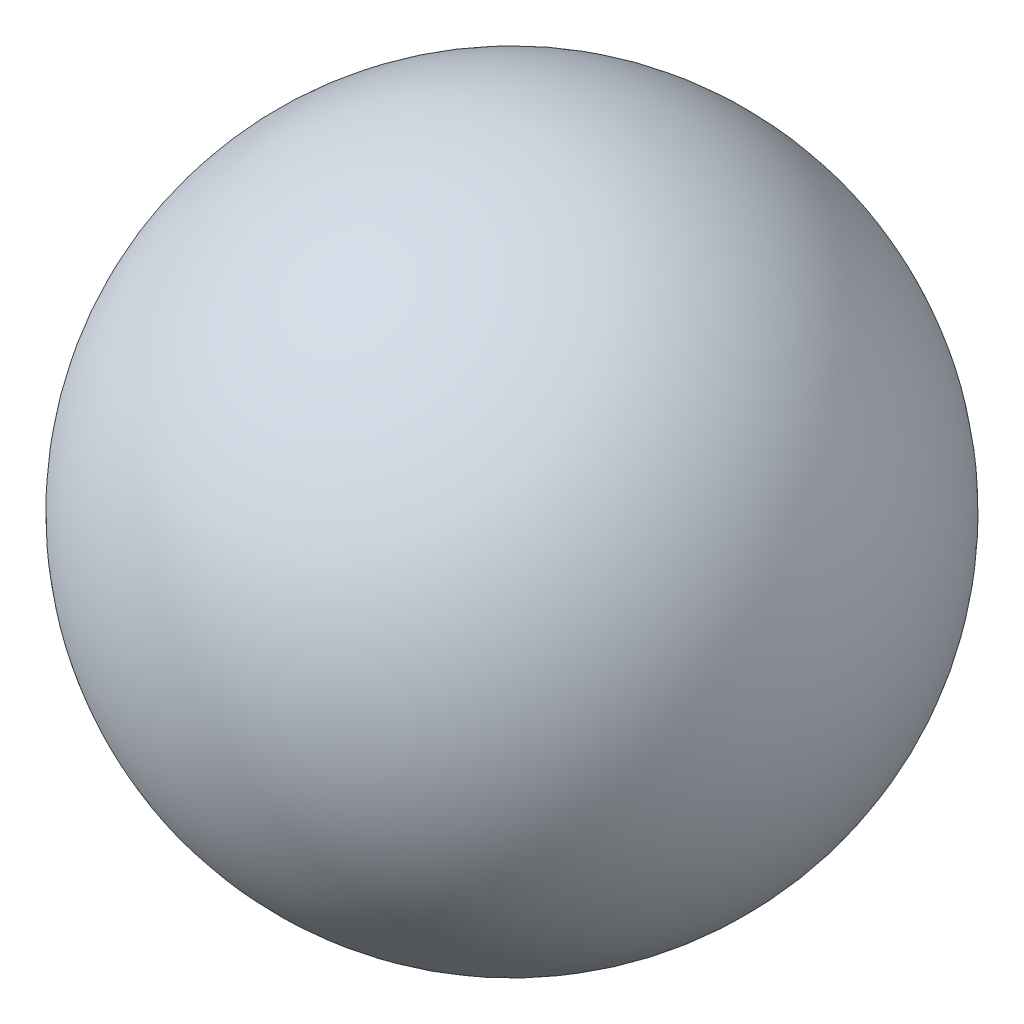
ISO-10303-21;
HEADER;
FILE_DESCRIPTION(('STEP AP214'),'2;1');
FILE_NAME('part.step','',(''),(''),'','','');
FILE_SCHEMA(('AUTOMOTIVE_DESIGN { 1 0 10303 214 1 1 1 1 }'));
ENDSEC;
DATA;
#1=APPLICATION_CONTEXT('core data for automotive mechanical design processes');
#2=APPLICATION_PROTOCOL_DEFINITION('international standard','automotive_design',2000,#1);
#3=PRODUCT_CONTEXT('',#1,'mechanical');
#4=PRODUCT('Part','Part','',(#3));
#5=PRODUCT_RELATED_PRODUCT_CATEGORY('part','',(#4));
#6=PRODUCT_DEFINITION_FORMATION('','',#4);
#7=PRODUCT_DEFINITION_CONTEXT('part definition',#1,'design');
#8=PRODUCT_DEFINITION('design','',#6,#7);
#9=PRODUCT_DEFINITION_SHAPE('','',#8);
#10=(LENGTH_UNIT() NAMED_UNIT(*) SI_UNIT(.MILLI.,.METRE.));
#11=(NAMED_UNIT(*) PLANE_ANGLE_UNIT() SI_UNIT($,.RADIAN.));
#12=(NAMED_UNIT(*) SI_UNIT($,.STERADIAN.) SOLID_ANGLE_UNIT());
#13=UNCERTAINTY_MEASURE_WITH_UNIT(LENGTH_MEASURE(1.E-05),#10,'distance_accuracy_value','');
#14=(GEOMETRIC_REPRESENTATION_CONTEXT(3) GLOBAL_UNCERTAINTY_ASSIGNED_CONTEXT((#13)) GLOBAL_UNIT_ASSIGNED_CONTEXT((#10,
#11,#12)) REPRESENTATION_CONTEXT('',''));
#15=CARTESIAN_POINT('',(0.,0.,0.));
#16=DIRECTION('',(0.,0.,1.));
#17=DIRECTION('',(1.,0.,0.));
#18=AXIS2_PLACEMENT_3D('',#15,#16,#17);
#19=CARTESIAN_POINT('',(0.,0.,0.));
#20=DIRECTION('',(0.,0.,-1.));
#21=DIRECTION('',(1.,0.,0.));
#22=AXIS2_PLACEMENT_3D('',#19,#20,#21);
#23=SPHERICAL_SURFACE('',#22,6.35);
#24=CARTESIAN_POINT('',(0.,0.,-6.35));
#25=VERTEX_POINT('',#24);
#26=VERTEX_LOOP('',#25);
#27=FACE_BOUND('',#26,.T.);
#28=ADVANCED_FACE('F28',(#27),#23,.T.);
#29=CLOSED_SHELL('',(#28));
#30=MANIFOLD_SOLID_BREP('B2',#29);
#31=ADVANCED_BREP_SHAPE_REPRESENTATION('',(#18,#30),#14);
#32=SHAPE_DEFINITION_REPRESENTATION(#9,#31);
ENDSEC;
END-ISO-10303-21;
